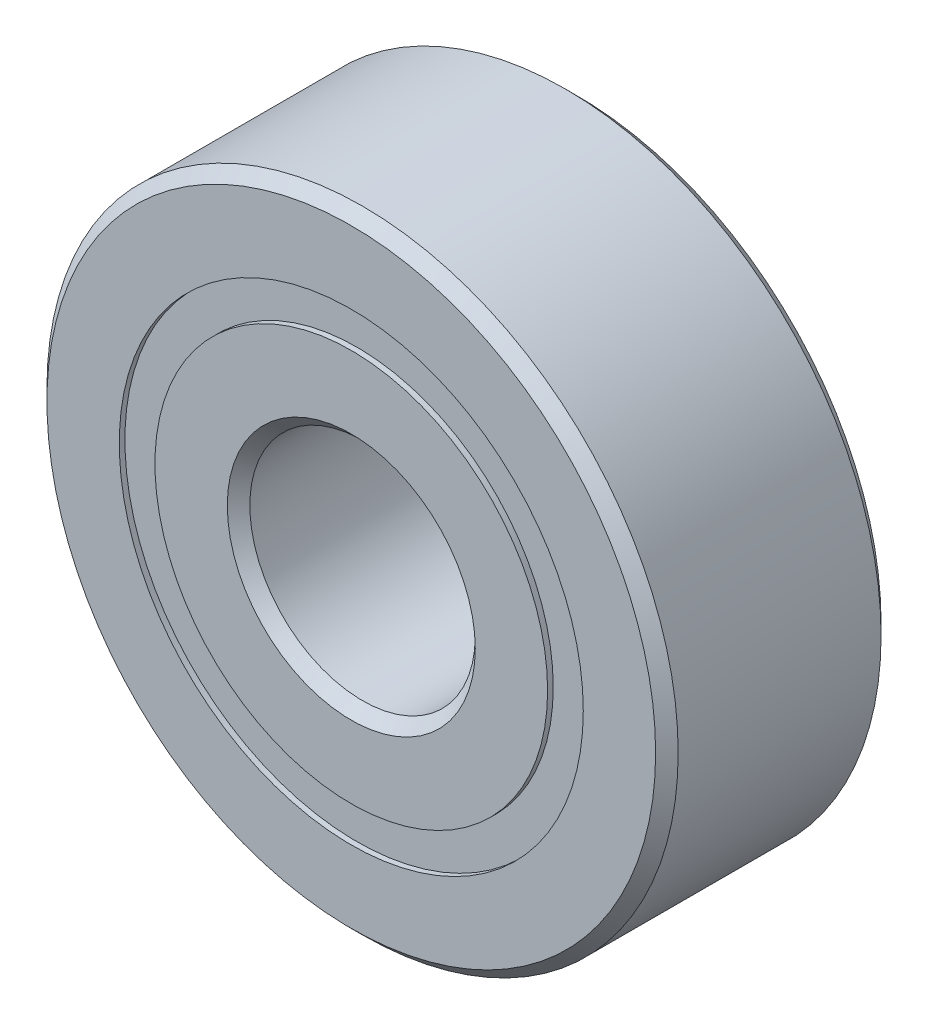
ISO-10303-21;
HEADER;
FILE_DESCRIPTION(('STEP AP214'),'2;1');
FILE_NAME('part.step','',(''),(''),'','','');
FILE_SCHEMA(('AUTOMOTIVE_DESIGN { 1 0 10303 214 1 1 1 1 }'));
ENDSEC;
DATA;
#1=APPLICATION_CONTEXT('core data for automotive mechanical design processes');
#2=APPLICATION_PROTOCOL_DEFINITION('international standard','automotive_design',2000,#1);
#3=PRODUCT_CONTEXT('',#1,'mechanical');
#4=PRODUCT('Part','Part','',(#3));
#5=PRODUCT_RELATED_PRODUCT_CATEGORY('part','',(#4));
#6=PRODUCT_DEFINITION_FORMATION('','',#4);
#7=PRODUCT_DEFINITION_CONTEXT('part definition',#1,'design');
#8=PRODUCT_DEFINITION('design','',#6,#7);
#9=PRODUCT_DEFINITION_SHAPE('','',#8);
#10=(LENGTH_UNIT() NAMED_UNIT(*) SI_UNIT(.MILLI.,.METRE.));
#11=(NAMED_UNIT(*) PLANE_ANGLE_UNIT() SI_UNIT($,.RADIAN.));
#12=(NAMED_UNIT(*) SI_UNIT($,.STERADIAN.) SOLID_ANGLE_UNIT());
#13=UNCERTAINTY_MEASURE_WITH_UNIT(LENGTH_MEASURE(1.E-05),#10,'distance_accuracy_value','');
#14=(GEOMETRIC_REPRESENTATION_CONTEXT(3) GLOBAL_UNCERTAINTY_ASSIGNED_CONTEXT((#13)) GLOBAL_UNIT_ASSIGNED_CONTEXT((#10,
#11,#12)) REPRESENTATION_CONTEXT('',''));
#15=CARTESIAN_POINT('',(0.,0.,0.));
#16=DIRECTION('',(0.,0.,1.));
#17=DIRECTION('',(1.,0.,0.));
#18=AXIS2_PLACEMENT_3D('',#15,#16,#17);
#19=CARTESIAN_POINT('',(0.,5.1456043956044,-2.375));
#20=DIRECTION('',(0.,0.,1.));
#21=DIRECTION('',(1.,0.,0.));
#22=AXIS2_PLACEMENT_3D('',#19,#20,#21);
#23=PLANE('',#22);
#24=CARTESIAN_POINT('',(0.,0.,-2.375));
#25=DIRECTION('',(0.,0.,1.));
#26=DIRECTION('',(1.,0.,0.));
#27=AXIS2_PLACEMENT_3D('',#24,#25,#26);
#28=CIRCLE('',#27,5.1456043956044);
#29=CARTESIAN_POINT('',(5.1456043956044,0.,-2.375));
#30=VERTEX_POINT('',#29);
#31=EDGE_CURVE('E55',#30,#30,#28,.T.);
#32=ORIENTED_EDGE('',*,*,#31,.F.);
#33=EDGE_LOOP('',(#32));
#34=FACE_BOUND('',#33,.T.);
#35=CARTESIAN_POINT('',(0.,0.,-2.375));
#36=DIRECTION('',(0.,0.,1.));
#37=DIRECTION('',(1.,0.,0.));
#38=AXIS2_PLACEMENT_3D('',#35,#36,#37);
#39=CIRCLE('',#38,4.3543956043956);
#40=CARTESIAN_POINT('',(4.3543956043956,0.,-2.375));
#41=VERTEX_POINT('',#40);
#42=EDGE_CURVE('E11',#41,#41,#39,.T.);
#43=ORIENTED_EDGE('',*,*,#42,.T.);
#44=EDGE_LOOP('',(#43));
#45=FACE_BOUND('',#44,.T.);
#46=ADVANCED_FACE('F41',(#34,#45),#23,.F.);
#47=CARTESIAN_POINT('',(0.,0.,2.5));
#48=DIRECTION('',(0.,0.,1.));
#49=DIRECTION('',(1.,0.,0.));
#50=AXIS2_PLACEMENT_3D('',#47,#48,#49);
#51=CYLINDRICAL_SURFACE('',#50,4.3543956043956);
#52=ORIENTED_EDGE('',*,*,#42,.F.);
#53=EDGE_LOOP('',(#52));
#54=FACE_BOUND('',#53,.T.);
#55=CARTESIAN_POINT('',(0.,0.,-1.17943661934675));
#56=DIRECTION('',(0.,0.,1.));
#57=DIRECTION('',(1.,0.,0.));
#58=AXIS2_PLACEMENT_3D('',#55,#56,#57);
#59=CIRCLE('',#58,4.3543956043956);
#60=CARTESIAN_POINT('',(4.3543956043956,0.,-1.17943661934675));
#61=VERTEX_POINT('',#60);
#62=EDGE_CURVE('E47',#61,#61,#59,.T.);
#63=ORIENTED_EDGE('',*,*,#62,.T.);
#64=EDGE_LOOP('',(#63));
#65=FACE_BOUND('',#64,.T.);
#66=ADVANCED_FACE('F64',(#54,#65),#51,.F.);
#67=CARTESIAN_POINT('',(0.,5.1456043956044,-1.17943661934675));
#68=DIRECTION('',(0.,0.,-1.));
#69=DIRECTION('',(-1.,0.,0.));
#70=AXIS2_PLACEMENT_3D('',#67,#68,#69);
#71=PLANE('',#70);
#72=ORIENTED_EDGE('',*,*,#62,.F.);
#73=EDGE_LOOP('',(#72));
#74=FACE_BOUND('',#73,.T.);
#75=CARTESIAN_POINT('',(0.,0.,-1.17943661934675));
#76=DIRECTION('',(0.,0.,1.));
#77=DIRECTION('',(1.,0.,0.));
#78=AXIS2_PLACEMENT_3D('',#75,#76,#77);
#79=CIRCLE('',#78,5.1456043956044);
#80=CARTESIAN_POINT('',(5.1456043956044,0.,-1.17943661934675));
#81=VERTEX_POINT('',#80);
#82=EDGE_CURVE('E51',#81,#81,#79,.T.);
#83=ORIENTED_EDGE('',*,*,#82,.T.);
#84=EDGE_LOOP('',(#83));
#85=FACE_BOUND('',#84,.T.);
#86=ADVANCED_FACE('F68',(#74,#85),#71,.F.);
#87=CARTESIAN_POINT('',(0.,0.,2.5));
#88=DIRECTION('',(0.,0.,1.));
#89=DIRECTION('',(1.,0.,0.));
#90=AXIS2_PLACEMENT_3D('',#87,#88,#89);
#91=CYLINDRICAL_SURFACE('',#90,5.1456043956044);
#92=ORIENTED_EDGE('',*,*,#82,.F.);
#93=EDGE_LOOP('',(#92));
#94=FACE_BOUND('',#93,.T.);
#95=ORIENTED_EDGE('',*,*,#31,.T.);
#96=EDGE_LOOP('',(#95));
#97=FACE_BOUND('',#96,.T.);
#98=ADVANCED_FACE('F61',(#94,#97),#91,.T.);
#99=CLOSED_SHELL('',(#46,#66,#86,#98));
#100=MANIFOLD_SOLID_BREP('B2',#99);
#101=CARTESIAN_POINT('',(0.,5.1456043956044,2.375));
#102=DIRECTION('',(0.,0.,-1.));
#103=DIRECTION('',(-1.,0.,0.));
#104=AXIS2_PLACEMENT_3D('',#101,#102,#103);
#105=PLANE('',#104);
#106=CARTESIAN_POINT('',(0.,0.,2.375));
#107=DIRECTION('',(0.,0.,1.));
#108=DIRECTION('',(1.,0.,0.));
#109=AXIS2_PLACEMENT_3D('',#106,#107,#108);
#110=CIRCLE('',#109,4.3543956043956);
#111=CARTESIAN_POINT('',(4.3543956043956,0.,2.375));
#112=VERTEX_POINT('',#111);
#113=EDGE_CURVE('E40',#112,#112,#110,.T.);
#114=ORIENTED_EDGE('',*,*,#113,.F.);
#115=EDGE_LOOP('',(#114));
#116=FACE_BOUND('',#115,.T.);
#117=CARTESIAN_POINT('',(0.,0.,2.375));
#118=DIRECTION('',(0.,0.,1.));
#119=DIRECTION('',(1.,0.,0.));
#120=AXIS2_PLACEMENT_3D('',#117,#118,#119);
#121=CIRCLE('',#120,5.1456043956044);
#122=CARTESIAN_POINT('',(5.1456043956044,0.,2.375));
#123=VERTEX_POINT('',#122);
#124=EDGE_CURVE('E122',#123,#123,#121,.T.);
#125=ORIENTED_EDGE('',*,*,#124,.T.);
#126=EDGE_LOOP('',(#125));
#127=FACE_BOUND('',#126,.T.);
#128=ADVANCED_FACE('F108',(#116,#127),#105,.F.);
#129=CARTESIAN_POINT('',(0.,0.,2.5));
#130=DIRECTION('',(0.,0.,1.));
#131=DIRECTION('',(1.,0.,0.));
#132=AXIS2_PLACEMENT_3D('',#129,#130,#131);
#133=CYLINDRICAL_SURFACE('',#132,4.3543956043956);
#134=CARTESIAN_POINT('',(0.,0.,1.17943661934675));
#135=DIRECTION('',(0.,0.,1.));
#136=DIRECTION('',(1.,0.,0.));
#137=AXIS2_PLACEMENT_3D('',#134,#135,#136);
#138=CIRCLE('',#137,4.3543956043956);
#139=CARTESIAN_POINT('',(4.3543956043956,0.,1.17943661934675));
#140=VERTEX_POINT('',#139);
#141=EDGE_CURVE('E114',#140,#140,#138,.T.);
#142=ORIENTED_EDGE('',*,*,#141,.F.);
#143=EDGE_LOOP('',(#142));
#144=FACE_BOUND('',#143,.T.);
#145=ORIENTED_EDGE('',*,*,#113,.T.);
#146=EDGE_LOOP('',(#145));
#147=FACE_BOUND('',#146,.T.);
#148=ADVANCED_FACE('F137',(#144,#147),#133,.F.);
#149=CARTESIAN_POINT('',(0.,5.1456043956044,1.17943661934675));
#150=DIRECTION('',(0.,0.,1.));
#151=DIRECTION('',(1.,0.,0.));
#152=AXIS2_PLACEMENT_3D('',#149,#150,#151);
#153=PLANE('',#152);
#154=CARTESIAN_POINT('',(0.,0.,1.17943661934675));
#155=DIRECTION('',(0.,0.,1.));
#156=DIRECTION('',(1.,0.,0.));
#157=AXIS2_PLACEMENT_3D('',#154,#155,#156);
#158=CIRCLE('',#157,5.1456043956044);
#159=CARTESIAN_POINT('',(5.1456043956044,0.,1.17943661934675));
#160=VERTEX_POINT('',#159);
#161=EDGE_CURVE('E118',#160,#160,#158,.T.);
#162=ORIENTED_EDGE('',*,*,#161,.F.);
#163=EDGE_LOOP('',(#162));
#164=FACE_BOUND('',#163,.T.);
#165=ORIENTED_EDGE('',*,*,#141,.T.);
#166=EDGE_LOOP('',(#165));
#167=FACE_BOUND('',#166,.T.);
#168=ADVANCED_FACE('F132',(#164,#167),#153,.F.);
#169=CARTESIAN_POINT('',(0.,0.,2.5));
#170=DIRECTION('',(0.,0.,1.));
#171=DIRECTION('',(1.,0.,0.));
#172=AXIS2_PLACEMENT_3D('',#169,#170,#171);
#173=CYLINDRICAL_SURFACE('',#172,5.1456043956044);
#174=ORIENTED_EDGE('',*,*,#124,.F.);
#175=EDGE_LOOP('',(#174));
#176=FACE_BOUND('',#175,.T.);
#177=ORIENTED_EDGE('',*,*,#161,.T.);
#178=EDGE_LOOP('',(#177));
#179=FACE_BOUND('',#178,.T.);
#180=ADVANCED_FACE('F129',(#176,#179),#173,.T.);
#181=CLOSED_SHELL('',(#128,#148,#168,#180));
#182=MANIFOLD_SOLID_BREP('B6',#181);
#183=CARTESIAN_POINT('',(-2.37499999999995,4.11362066797611,0.));
#184=DIRECTION('',(0.,0.,1.));
#185=DIRECTION('',(-0.499999999999989,0.866025403784445,0.));
#186=AXIS2_PLACEMENT_3D('',#183,#184,#185);
#187=SPHERICAL_SURFACE('',#186,1.17943661934675);
#188=CARTESIAN_POINT('',(-2.37499999999995,4.11362066797611,1.17943661934675));
#189=VERTEX_POINT('',#188);
#190=VERTEX_LOOP('',#189);
#191=FACE_BOUND('',#190,.T.);
#192=ADVANCED_FACE('F175',(#191),#187,.T.);
#193=CLOSED_SHELL('',(#192));
#194=MANIFOLD_SOLID_BREP('B35',#193);
#195=CARTESIAN_POINT('',(-4.11362066797606,2.37500000000005,0.));
#196=DIRECTION('',(0.,0.,1.));
#197=DIRECTION('',(-0.866025403784433,0.50000000000001,0.));
#198=AXIS2_PLACEMENT_3D('',#195,#196,#197);
#199=SPHERICAL_SURFACE('',#198,1.17943661934675);
#200=CARTESIAN_POINT('',(-4.11362066797606,2.37500000000005,1.17943661934675));
#201=VERTEX_POINT('',#200);
#202=VERTEX_LOOP('',#201);
#203=FACE_BOUND('',#202,.T.);
#204=ADVANCED_FACE('F195',(#203),#199,.T.);
#205=CLOSED_SHELL('',(#204));
#206=MANIFOLD_SOLID_BREP('B104',#205);
#207=CARTESIAN_POINT('',(-4.75,0.,0.));
#208=DIRECTION('',(0.,0.,1.));
#209=DIRECTION('',(-1.,0.,0.));
#210=AXIS2_PLACEMENT_3D('',#207,#208,#209);
#211=SPHERICAL_SURFACE('',#210,1.17943661934675);
#212=CARTESIAN_POINT('',(-4.75,0.,1.17943661934675));
#213=VERTEX_POINT('',#212);
#214=VERTEX_LOOP('',#213);
#215=FACE_BOUND('',#214,.T.);
#216=ADVANCED_FACE('F215',(#215),#211,.T.);
#217=CLOSED_SHELL('',(#216));
#218=MANIFOLD_SOLID_BREP('B171',#217);
#219=CARTESIAN_POINT('',(-4.1136206679761,-2.37499999999996,0.));
#220=DIRECTION('',(0.,0.,1.));
#221=DIRECTION('',(-0.866025403784443,-0.499999999999992,0.));
#222=AXIS2_PLACEMENT_3D('',#219,#220,#221);
#223=SPHERICAL_SURFACE('',#222,1.17943661934675);
#224=CARTESIAN_POINT('',(-4.1136206679761,-2.37499999999996,1.17943661934675));
#225=VERTEX_POINT('',#224);
#226=VERTEX_LOOP('',#225);
#227=FACE_BOUND('',#226,.T.);
#228=ADVANCED_FACE('F235',(#227),#223,.T.);
#229=CLOSED_SHELL('',(#228));
#230=MANIFOLD_SOLID_BREP('B191',#229);
#231=CARTESIAN_POINT('',(-2.37500000000003,-4.11362066797606,0.));
#232=DIRECTION('',(0.,0.,1.));
#233=DIRECTION('',(-0.500000000000007,-0.866025403784435,0.));
#234=AXIS2_PLACEMENT_3D('',#231,#232,#233);
#235=SPHERICAL_SURFACE('',#234,1.17943661934675);
#236=CARTESIAN_POINT('',(-2.37500000000003,-4.11362066797606,1.17943661934675));
#237=VERTEX_POINT('',#236);
#238=VERTEX_LOOP('',#237);
#239=FACE_BOUND('',#238,.T.);
#240=ADVANCED_FACE('F255',(#239),#235,.T.);
#241=CLOSED_SHELL('',(#240));
#242=MANIFOLD_SOLID_BREP('B211',#241);
#243=CARTESIAN_POINT('',(0.,-4.75,0.));
#244=DIRECTION('',(0.,0.,1.));
#245=DIRECTION('',(0.,-1.,0.));
#246=AXIS2_PLACEMENT_3D('',#243,#244,#245);
#247=SPHERICAL_SURFACE('',#246,1.17943661934675);
#248=CARTESIAN_POINT('',(0.,-4.75,1.17943661934675));
#249=VERTEX_POINT('',#248);
#250=VERTEX_LOOP('',#249);
#251=FACE_BOUND('',#250,.T.);
#252=ADVANCED_FACE('F275',(#251),#247,.T.);
#253=CLOSED_SHELL('',(#252));
#254=MANIFOLD_SOLID_BREP('B231',#253);
#255=CARTESIAN_POINT('',(2.37499999999998,-4.1136206679761,0.));
#256=DIRECTION('',(0.,0.,1.));
#257=DIRECTION('',(0.499999999999995,-0.866025403784442,0.));
#258=AXIS2_PLACEMENT_3D('',#255,#256,#257);
#259=SPHERICAL_SURFACE('',#258,1.17943661934675);
#260=CARTESIAN_POINT('',(2.37499999999998,-4.1136206679761,1.17943661934675));
#261=VERTEX_POINT('',#260);
#262=VERTEX_LOOP('',#261);
#263=FACE_BOUND('',#262,.T.);
#264=ADVANCED_FACE('F295',(#263),#259,.T.);
#265=CLOSED_SHELL('',(#264));
#266=MANIFOLD_SOLID_BREP('B251',#265);
#267=CARTESIAN_POINT('',(4.11362066797607,-2.37500000000002,0.));
#268=DIRECTION('',(0.,0.,1.));
#269=DIRECTION('',(0.866025403784436,-0.500000000000004,0.));
#270=AXIS2_PLACEMENT_3D('',#267,#268,#269);
#271=SPHERICAL_SURFACE('',#270,1.17943661934675);
#272=CARTESIAN_POINT('',(4.11362066797607,-2.37500000000002,1.17943661934675));
#273=VERTEX_POINT('',#272);
#274=VERTEX_LOOP('',#273);
#275=FACE_BOUND('',#274,.T.);
#276=ADVANCED_FACE('F315',(#275),#271,.T.);
#277=CLOSED_SHELL('',(#276));
#278=MANIFOLD_SOLID_BREP('B271',#277);
#279=CARTESIAN_POINT('',(4.75,0.,0.));
#280=DIRECTION('',(0.,0.,1.));
#281=DIRECTION('',(1.,0.,0.));
#282=AXIS2_PLACEMENT_3D('',#279,#280,#281);
#283=SPHERICAL_SURFACE('',#282,1.17943661934675);
#284=CARTESIAN_POINT('',(4.75,0.,1.17943661934675));
#285=VERTEX_POINT('',#284);
#286=VERTEX_LOOP('',#285);
#287=FACE_BOUND('',#286,.T.);
#288=ADVANCED_FACE('F335',(#287),#283,.T.);
#289=CLOSED_SHELL('',(#288));
#290=MANIFOLD_SOLID_BREP('B291',#289);
#291=CARTESIAN_POINT('',(4.11362066797609,2.37499999999999,0.));
#292=DIRECTION('',(0.,0.,1.));
#293=DIRECTION('',(0.86602540378444,0.499999999999998,0.));
#294=AXIS2_PLACEMENT_3D('',#291,#292,#293);
#295=SPHERICAL_SURFACE('',#294,1.17943661934675);
#296=CARTESIAN_POINT('',(4.11362066797609,2.37499999999999,1.17943661934675));
#297=VERTEX_POINT('',#296);
#298=VERTEX_LOOP('',#297);
#299=FACE_BOUND('',#298,.T.);
#300=ADVANCED_FACE('F355',(#299),#295,.T.);
#301=CLOSED_SHELL('',(#300));
#302=MANIFOLD_SOLID_BREP('B311',#301);
#303=CARTESIAN_POINT('',(2.375,4.11362066797608,0.));
#304=DIRECTION('',(0.,0.,1.));
#305=DIRECTION('',(0.500000000000001,0.866025403784438,0.));
#306=AXIS2_PLACEMENT_3D('',#303,#304,#305);
#307=SPHERICAL_SURFACE('',#306,1.17943661934675);
#308=CARTESIAN_POINT('',(2.375,4.11362066797608,1.17943661934675));
#309=VERTEX_POINT('',#308);
#310=VERTEX_LOOP('',#309);
#311=FACE_BOUND('',#310,.T.);
#312=ADVANCED_FACE('F375',(#311),#307,.T.);
#313=CLOSED_SHELL('',(#312));
#314=MANIFOLD_SOLID_BREP('B331',#313);
#315=CARTESIAN_POINT('',(0.,4.75,0.));
#316=DIRECTION('',(0.,0.,1.));
#317=DIRECTION('',(0.,1.,0.));
#318=AXIS2_PLACEMENT_3D('',#315,#316,#317);
#319=SPHERICAL_SURFACE('',#318,1.17943661934675);
#320=CARTESIAN_POINT('',(0.,4.75,1.17943661934675));
#321=VERTEX_POINT('',#320);
#322=VERTEX_LOOP('',#321);
#323=FACE_BOUND('',#322,.T.);
#324=ADVANCED_FACE('F397',(#323),#319,.T.);
#325=CLOSED_SHELL('',(#324));
#326=MANIFOLD_SOLID_BREP('B351',#325);
#327=CARTESIAN_POINT('',(0.,4.3543956043956,2.5));
#328=DIRECTION('',(0.,0.,-1.));
#329=DIRECTION('',(-1.,0.,0.));
#330=AXIS2_PLACEMENT_3D('',#327,#328,#329);
#331=PLANE('',#330);
#332=CARTESIAN_POINT('',(0.,0.,2.5));
#333=DIRECTION('',(0.,0.,1.));
#334=DIRECTION('',(1.,0.,0.));
#335=AXIS2_PLACEMENT_3D('',#332,#333,#334);
#336=CIRCLE('',#335,2.75);
#337=CARTESIAN_POINT('',(2.75,0.,2.5));
#338=VERTEX_POINT('',#337);
#339=EDGE_CURVE('E444',#338,#338,#336,.T.);
#340=ORIENTED_EDGE('',*,*,#339,.F.);
#341=EDGE_LOOP('',(#340));
#342=FACE_BOUND('',#341,.T.);
#343=CARTESIAN_POINT('',(0.,0.,2.5));
#344=DIRECTION('',(0.,0.,1.));
#345=DIRECTION('',(1.,0.,0.));
#346=AXIS2_PLACEMENT_3D('',#343,#344,#345);
#347=CIRCLE('',#346,4.3543956043956);
#348=CARTESIAN_POINT('',(4.3543956043956,0.,2.5));
#349=VERTEX_POINT('',#348);
#350=EDGE_CURVE('E396',#349,#349,#347,.T.);
#351=ORIENTED_EDGE('',*,*,#350,.T.);
#352=EDGE_LOOP('',(#351));
#353=FACE_BOUND('',#352,.T.);
#354=ADVANCED_FACE('F416',(#342,#353),#331,.F.);
#355=CARTESIAN_POINT('',(0.,0.,2.5));
#356=DIRECTION('',(0.,0.,1.));
#357=DIRECTION('',(1.,0.,0.));
#358=AXIS2_PLACEMENT_3D('',#355,#356,#357);
#359=CYLINDRICAL_SURFACE('',#358,4.3543956043956);
#360=ORIENTED_EDGE('',*,*,#350,.F.);
#361=EDGE_LOOP('',(#360));
#362=FACE_BOUND('',#361,.T.);
#363=CARTESIAN_POINT('',(0.,0.,1.11111111111111));
#364=DIRECTION('',(0.,0.,1.));
#365=DIRECTION('',(1.,0.,0.));
#366=AXIS2_PLACEMENT_3D('',#363,#364,#365);
#367=CIRCLE('',#366,4.3543956043956);
#368=CARTESIAN_POINT('',(4.3543956043956,0.,1.11111111111111));
#369=VERTEX_POINT('',#368);
#370=EDGE_CURVE('E422',#369,#369,#367,.T.);
#371=ORIENTED_EDGE('',*,*,#370,.T.);
#372=EDGE_LOOP('',(#371));
#373=FACE_BOUND('',#372,.T.);
#374=ADVANCED_FACE('F451',(#362,#373),#359,.T.);
#375=CARTESIAN_POINT('',(0.,0.,0.));
#376=DIRECTION('',(0.,0.,1.));
#377=DIRECTION('',(1.,0.,0.));
#378=AXIS2_PLACEMENT_3D('',#375,#376,#377);
#379=TOROIDAL_SURFACE('',#378,4.75,1.17943661934675);
#380=ORIENTED_EDGE('',*,*,#370,.F.);
#381=EDGE_LOOP('',(#380));
#382=FACE_BOUND('',#381,.T.);
#383=CARTESIAN_POINT('',(0.,0.,-1.11111111111111));
#384=DIRECTION('',(0.,0.,1.));
#385=DIRECTION('',(1.,0.,0.));
#386=AXIS2_PLACEMENT_3D('',#383,#384,#385);
#387=CIRCLE('',#386,4.3543956043956);
#388=CARTESIAN_POINT('',(4.3543956043956,0.,-1.11111111111111));
#389=VERTEX_POINT('',#388);
#390=EDGE_CURVE('E426',#389,#389,#387,.T.);
#391=ORIENTED_EDGE('',*,*,#390,.T.);
#392=EDGE_LOOP('',(#391));
#393=FACE_BOUND('',#392,.T.);
#394=ADVANCED_FACE('F455',(#382,#393),#379,.F.);
#395=CARTESIAN_POINT('',(0.,0.,2.5));
#396=DIRECTION('',(0.,0.,1.));
#397=DIRECTION('',(1.,0.,0.));
#398=AXIS2_PLACEMENT_3D('',#395,#396,#397);
#399=CYLINDRICAL_SURFACE('',#398,4.3543956043956);
#400=ORIENTED_EDGE('',*,*,#390,.F.);
#401=EDGE_LOOP('',(#400));
#402=FACE_BOUND('',#401,.T.);
#403=CARTESIAN_POINT('',(0.,0.,-2.5));
#404=DIRECTION('',(0.,0.,1.));
#405=DIRECTION('',(1.,0.,0.));
#406=AXIS2_PLACEMENT_3D('',#403,#404,#405);
#407=CIRCLE('',#406,4.3543956043956);
#408=CARTESIAN_POINT('',(4.3543956043956,0.,-2.5));
#409=VERTEX_POINT('',#408);
#410=EDGE_CURVE('E430',#409,#409,#407,.T.);
#411=ORIENTED_EDGE('',*,*,#410,.T.);
#412=EDGE_LOOP('',(#411));
#413=FACE_BOUND('',#412,.T.);
#414=ADVANCED_FACE('F460',(#402,#413),#399,.T.);
#415=CARTESIAN_POINT('',(0.,2.75,-2.5));
#416=DIRECTION('',(0.,0.,1.));
#417=DIRECTION('',(1.,0.,0.));
#418=AXIS2_PLACEMENT_3D('',#415,#416,#417);
#419=PLANE('',#418);
#420=ORIENTED_EDGE('',*,*,#410,.F.);
#421=EDGE_LOOP('',(#420));
#422=FACE_BOUND('',#421,.T.);
#423=CARTESIAN_POINT('',(0.,0.,-2.5));
#424=DIRECTION('',(0.,0.,1.));
#425=DIRECTION('',(1.,0.,0.));
#426=AXIS2_PLACEMENT_3D('',#423,#424,#425);
#427=CIRCLE('',#426,2.75);
#428=CARTESIAN_POINT('',(2.75,0.,-2.5));
#429=VERTEX_POINT('',#428);
#430=EDGE_CURVE('E435',#429,#429,#427,.T.);
#431=ORIENTED_EDGE('',*,*,#430,.T.);
#432=EDGE_LOOP('',(#431));
#433=FACE_BOUND('',#432,.T.);
#434=ADVANCED_FACE('F466',(#422,#433),#419,.F.);
#435=CARTESIAN_POINT('',(0.,0.,-2.25));
#436=DIRECTION('',(0.,0.,-1.));
#437=DIRECTION('',(-1.,0.,0.));
#438=AXIS2_PLACEMENT_3D('',#435,#436,#437);
#439=CONICAL_SURFACE('',#438,2.5,0.785398163397443);
#440=ORIENTED_EDGE('',*,*,#430,.F.);
#441=EDGE_LOOP('',(#440));
#442=FACE_BOUND('',#441,.T.);
#443=CARTESIAN_POINT('',(0.,0.,-2.25));
#444=DIRECTION('',(0.,0.,1.));
#445=DIRECTION('',(1.,0.,0.));
#446=AXIS2_PLACEMENT_3D('',#443,#444,#445);
#447=CIRCLE('',#446,2.5);
#448=CARTESIAN_POINT('',(2.5,0.,-2.25));
#449=VERTEX_POINT('',#448);
#450=EDGE_CURVE('E438',#449,#449,#447,.T.);
#451=ORIENTED_EDGE('',*,*,#450,.T.);
#452=EDGE_LOOP('',(#451));
#453=FACE_BOUND('',#452,.T.);
#454=ADVANCED_FACE('F470',(#442,#453),#439,.F.);
#455=CARTESIAN_POINT('',(0.,0.,2.5));
#456=DIRECTION('',(0.,0.,1.));
#457=DIRECTION('',(1.,0.,0.));
#458=AXIS2_PLACEMENT_3D('',#455,#456,#457);
#459=CYLINDRICAL_SURFACE('',#458,2.5);
#460=ORIENTED_EDGE('',*,*,#450,.F.);
#461=EDGE_LOOP('',(#460));
#462=FACE_BOUND('',#461,.T.);
#463=CARTESIAN_POINT('',(0.,0.,2.25));
#464=DIRECTION('',(0.,0.,1.));
#465=DIRECTION('',(1.,0.,0.));
#466=AXIS2_PLACEMENT_3D('',#463,#464,#465);
#467=CIRCLE('',#466,2.5);
#468=CARTESIAN_POINT('',(2.5,0.,2.25));
#469=VERTEX_POINT('',#468);
#470=EDGE_CURVE('E441',#469,#469,#467,.T.);
#471=ORIENTED_EDGE('',*,*,#470,.T.);
#472=EDGE_LOOP('',(#471));
#473=FACE_BOUND('',#472,.T.);
#474=ADVANCED_FACE('F474',(#462,#473),#459,.F.);
#475=CARTESIAN_POINT('',(0.,0.,2.5));
#476=DIRECTION('',(0.,0.,1.));
#477=DIRECTION('',(1.,0.,0.));
#478=AXIS2_PLACEMENT_3D('',#475,#476,#477);
#479=CONICAL_SURFACE('',#478,2.75,0.785398163397453);
#480=ORIENTED_EDGE('',*,*,#470,.F.);
#481=EDGE_LOOP('',(#480));
#482=FACE_BOUND('',#481,.T.);
#483=ORIENTED_EDGE('',*,*,#339,.T.);
#484=EDGE_LOOP('',(#483));
#485=FACE_BOUND('',#484,.T.);
#486=ADVANCED_FACE('F448',(#482,#485),#479,.F.);
#487=CLOSED_SHELL('',(#354,#374,#394,#414,#434,#454,#474,#486));
#488=MANIFOLD_SOLID_BREP('B371',#487);
#489=CARTESIAN_POINT('',(0.,0.,2.25));
#490=DIRECTION('',(0.,0.,-1.));
#491=DIRECTION('',(-1.,0.,0.));
#492=AXIS2_PLACEMENT_3D('',#489,#490,#491);
#493=CONICAL_SURFACE('',#492,7.,0.785398163397449);
#494=CARTESIAN_POINT('',(0.,0.,2.5));
#495=DIRECTION('',(0.,0.,1.));
#496=DIRECTION('',(1.,0.,0.));
#497=AXIS2_PLACEMENT_3D('',#494,#495,#496);
#498=CIRCLE('',#497,6.75);
#499=CARTESIAN_POINT('',(6.75,0.,2.5));
#500=VERTEX_POINT('',#499);
#501=EDGE_CURVE('E565',#500,#500,#498,.T.);
#502=ORIENTED_EDGE('',*,*,#501,.F.);
#503=EDGE_LOOP('',(#502));
#504=FACE_BOUND('',#503,.T.);
#505=CARTESIAN_POINT('',(0.,0.,2.25));
#506=DIRECTION('',(0.,0.,1.));
#507=DIRECTION('',(1.,0.,0.));
#508=AXIS2_PLACEMENT_3D('',#505,#506,#507);
#509=CIRCLE('',#508,7.);
#510=CARTESIAN_POINT('',(7.,0.,2.25));
#511=VERTEX_POINT('',#510);
#512=EDGE_CURVE('E415',#511,#511,#509,.T.);
#513=ORIENTED_EDGE('',*,*,#512,.T.);
#514=EDGE_LOOP('',(#513));
#515=FACE_BOUND('',#514,.T.);
#516=ADVANCED_FACE('F537',(#504,#515),#493,.T.);
#517=CARTESIAN_POINT('',(0.,0.,2.5));
#518=DIRECTION('',(0.,0.,1.));
#519=DIRECTION('',(1.,0.,0.));
#520=AXIS2_PLACEMENT_3D('',#517,#518,#519);
#521=CYLINDRICAL_SURFACE('',#520,7.);
#522=ORIENTED_EDGE('',*,*,#512,.F.);
#523=EDGE_LOOP('',(#522));
#524=FACE_BOUND('',#523,.T.);
#525=CARTESIAN_POINT('',(0.,0.,-2.25));
#526=DIRECTION('',(0.,0.,1.));
#527=DIRECTION('',(1.,0.,0.));
#528=AXIS2_PLACEMENT_3D('',#525,#526,#527);
#529=CIRCLE('',#528,7.);
#530=CARTESIAN_POINT('',(7.,0.,-2.25));
#531=VERTEX_POINT('',#530);
#532=EDGE_CURVE('E543',#531,#531,#529,.T.);
#533=ORIENTED_EDGE('',*,*,#532,.T.);
#534=EDGE_LOOP('',(#533));
#535=FACE_BOUND('',#534,.T.);
#536=ADVANCED_FACE('F572',(#524,#535),#521,.T.);
#537=CARTESIAN_POINT('',(0.,0.,-2.5));
#538=DIRECTION('',(0.,0.,1.));
#539=DIRECTION('',(1.,0.,0.));
#540=AXIS2_PLACEMENT_3D('',#537,#538,#539);
#541=CONICAL_SURFACE('',#540,6.75,0.785398163397447);
#542=ORIENTED_EDGE('',*,*,#532,.F.);
#543=EDGE_LOOP('',(#542));
#544=FACE_BOUND('',#543,.T.);
#545=CARTESIAN_POINT('',(0.,0.,-2.5));
#546=DIRECTION('',(0.,0.,1.));
#547=DIRECTION('',(1.,0.,0.));
#548=AXIS2_PLACEMENT_3D('',#545,#546,#547);
#549=CIRCLE('',#548,6.75);
#550=CARTESIAN_POINT('',(6.75,0.,-2.5));
#551=VERTEX_POINT('',#550);
#552=EDGE_CURVE('E547',#551,#551,#549,.T.);
#553=ORIENTED_EDGE('',*,*,#552,.T.);
#554=EDGE_LOOP('',(#553));
#555=FACE_BOUND('',#554,.T.);
#556=ADVANCED_FACE('F576',(#544,#555),#541,.T.);
#557=CARTESIAN_POINT('',(0.,6.75,-2.5));
#558=DIRECTION('',(0.,0.,1.));
#559=DIRECTION('',(1.,0.,0.));
#560=AXIS2_PLACEMENT_3D('',#557,#558,#559);
#561=PLANE('',#560);
#562=ORIENTED_EDGE('',*,*,#552,.F.);
#563=EDGE_LOOP('',(#562));
#564=FACE_BOUND('',#563,.T.);
#565=CARTESIAN_POINT('',(0.,0.,-2.5));
#566=DIRECTION('',(0.,0.,1.));
#567=DIRECTION('',(1.,0.,0.));
#568=AXIS2_PLACEMENT_3D('',#565,#566,#567);
#569=CIRCLE('',#568,5.1456043956044);
#570=CARTESIAN_POINT('',(5.1456043956044,0.,-2.5));
#571=VERTEX_POINT('',#570);
#572=EDGE_CURVE('E551',#571,#571,#569,.T.);
#573=ORIENTED_EDGE('',*,*,#572,.T.);
#574=EDGE_LOOP('',(#573));
#575=FACE_BOUND('',#574,.T.);
#576=ADVANCED_FACE('F581',(#564,#575),#561,.F.);
#577=CARTESIAN_POINT('',(0.,0.,2.5));
#578=DIRECTION('',(0.,0.,1.));
#579=DIRECTION('',(1.,0.,0.));
#580=AXIS2_PLACEMENT_3D('',#577,#578,#579);
#581=CYLINDRICAL_SURFACE('',#580,5.1456043956044);
#582=ORIENTED_EDGE('',*,*,#572,.F.);
#583=EDGE_LOOP('',(#582));
#584=FACE_BOUND('',#583,.T.);
#585=CARTESIAN_POINT('',(0.,0.,-1.11111111111111));
#586=DIRECTION('',(0.,0.,1.));
#587=DIRECTION('',(1.,0.,0.));
#588=AXIS2_PLACEMENT_3D('',#585,#586,#587);
#589=CIRCLE('',#588,5.1456043956044);
#590=CARTESIAN_POINT('',(5.1456043956044,0.,-1.11111111111111));
#591=VERTEX_POINT('',#590);
#592=EDGE_CURVE('E556',#591,#591,#589,.T.);
#593=ORIENTED_EDGE('',*,*,#592,.T.);
#594=EDGE_LOOP('',(#593));
#595=FACE_BOUND('',#594,.T.);
#596=ADVANCED_FACE('F587',(#584,#595),#581,.F.);
#597=CARTESIAN_POINT('',(0.,0.,0.));
#598=DIRECTION('',(0.,0.,1.));
#599=DIRECTION('',(1.,0.,0.));
#600=AXIS2_PLACEMENT_3D('',#597,#598,#599);
#601=TOROIDAL_SURFACE('',#600,4.75,1.17943661934675);
#602=ORIENTED_EDGE('',*,*,#592,.F.);
#603=EDGE_LOOP('',(#602));
#604=FACE_BOUND('',#603,.T.);
#605=CARTESIAN_POINT('',(0.,0.,1.11111111111111));
#606=DIRECTION('',(0.,0.,1.));
#607=DIRECTION('',(1.,0.,0.));
#608=AXIS2_PLACEMENT_3D('',#605,#606,#607);
#609=CIRCLE('',#608,5.1456043956044);
#610=CARTESIAN_POINT('',(5.1456043956044,0.,1.11111111111111));
#611=VERTEX_POINT('',#610);
#612=EDGE_CURVE('E559',#611,#611,#609,.T.);
#613=ORIENTED_EDGE('',*,*,#612,.T.);
#614=EDGE_LOOP('',(#613));
#615=FACE_BOUND('',#614,.T.);
#616=ADVANCED_FACE('F591',(#604,#615),#601,.F.);
#617=CARTESIAN_POINT('',(0.,0.,2.5));
#618=DIRECTION('',(0.,0.,1.));
#619=DIRECTION('',(1.,0.,0.));
#620=AXIS2_PLACEMENT_3D('',#617,#618,#619);
#621=CYLINDRICAL_SURFACE('',#620,5.1456043956044);
#622=ORIENTED_EDGE('',*,*,#612,.F.);
#623=EDGE_LOOP('',(#622));
#624=FACE_BOUND('',#623,.T.);
#625=CARTESIAN_POINT('',(0.,0.,2.5));
#626=DIRECTION('',(0.,0.,1.));
#627=DIRECTION('',(1.,0.,0.));
#628=AXIS2_PLACEMENT_3D('',#625,#626,#627);
#629=CIRCLE('',#628,5.1456043956044);
#630=CARTESIAN_POINT('',(5.1456043956044,0.,2.5));
#631=VERTEX_POINT('',#630);
#632=EDGE_CURVE('E562',#631,#631,#629,.T.);
#633=ORIENTED_EDGE('',*,*,#632,.T.);
#634=EDGE_LOOP('',(#633));
#635=FACE_BOUND('',#634,.T.);
#636=ADVANCED_FACE('F595',(#624,#635),#621,.F.);
#637=CARTESIAN_POINT('',(0.,6.75,2.5));
#638=DIRECTION('',(0.,0.,-1.));
#639=DIRECTION('',(-1.,0.,0.));
#640=AXIS2_PLACEMENT_3D('',#637,#638,#639);
#641=PLANE('',#640);
#642=ORIENTED_EDGE('',*,*,#632,.F.);
#643=EDGE_LOOP('',(#642));
#644=FACE_BOUND('',#643,.T.);
#645=ORIENTED_EDGE('',*,*,#501,.T.);
#646=EDGE_LOOP('',(#645));
#647=FACE_BOUND('',#646,.T.);
#648=ADVANCED_FACE('F569',(#644,#647),#641,.F.);
#649=CLOSED_SHELL('',(#516,#536,#556,#576,#596,#616,#636,#648));
#650=MANIFOLD_SOLID_BREP('B391',#649);
#651=ADVANCED_BREP_SHAPE_REPRESENTATION('',(#18,#100,#182,#194,#206,#218,#230,#242,#254,#266,
#278,#290,#302,#314,#326,#488,#650),#14);
#652=SHAPE_DEFINITION_REPRESENTATION(#9,#651);
ENDSEC;
END-ISO-10303-21;
